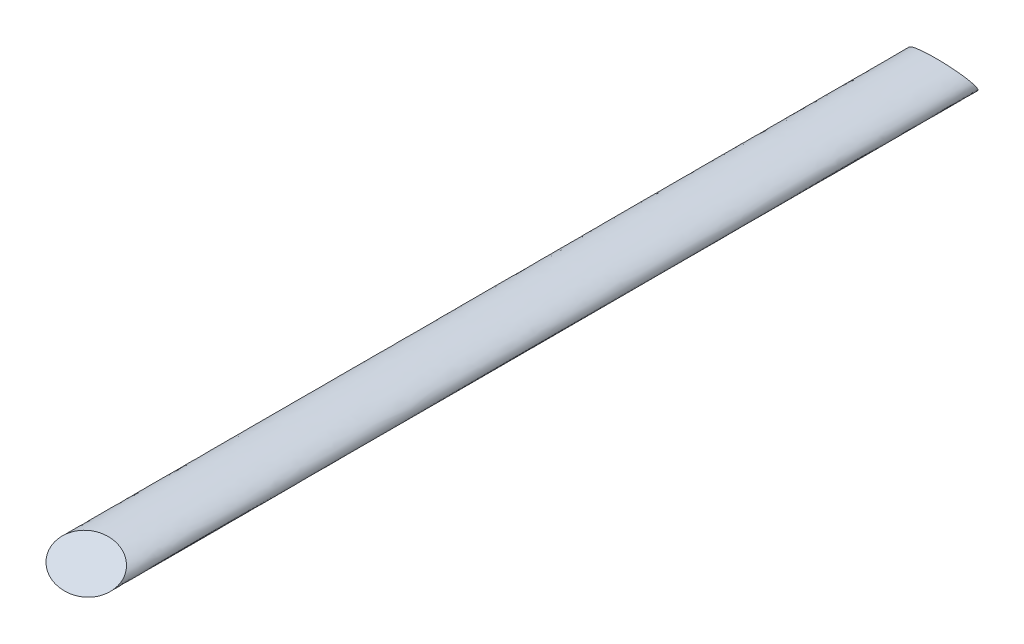
ISO-10303-21;
HEADER;
FILE_DESCRIPTION(('STEP AP214'),'2;1');
FILE_NAME('part.step','',(''),(''),'','','');
FILE_SCHEMA(('AUTOMOTIVE_DESIGN { 1 0 10303 214 1 1 1 1 }'));
ENDSEC;
DATA;
#1=APPLICATION_CONTEXT('core data for automotive mechanical design processes');
#2=APPLICATION_PROTOCOL_DEFINITION('international standard','automotive_design',2000,#1);
#3=PRODUCT_CONTEXT('',#1,'mechanical');
#4=PRODUCT('Part','Part','',(#3));
#5=PRODUCT_RELATED_PRODUCT_CATEGORY('part','',(#4));
#6=PRODUCT_DEFINITION_FORMATION('','',#4);
#7=PRODUCT_DEFINITION_CONTEXT('part definition',#1,'design');
#8=PRODUCT_DEFINITION('design','',#6,#7);
#9=PRODUCT_DEFINITION_SHAPE('','',#8);
#10=(LENGTH_UNIT() NAMED_UNIT(*) SI_UNIT(.MILLI.,.METRE.));
#11=(NAMED_UNIT(*) PLANE_ANGLE_UNIT() SI_UNIT($,.RADIAN.));
#12=(NAMED_UNIT(*) SI_UNIT($,.STERADIAN.) SOLID_ANGLE_UNIT());
#13=UNCERTAINTY_MEASURE_WITH_UNIT(LENGTH_MEASURE(1.E-05),#10,'distance_accuracy_value','');
#14=(GEOMETRIC_REPRESENTATION_CONTEXT(3) GLOBAL_UNCERTAINTY_ASSIGNED_CONTEXT((#13)) GLOBAL_UNIT_ASSIGNED_CONTEXT((#10,
#11,#12)) REPRESENTATION_CONTEXT('',''));
#15=CARTESIAN_POINT('',(0.,0.,0.));
#16=DIRECTION('',(0.,0.,1.));
#17=DIRECTION('',(1.,0.,0.));
#18=AXIS2_PLACEMENT_3D('',#15,#16,#17);
#19=CARTESIAN_POINT('',(0.,0.,1778.));
#20=DIRECTION('',(0.,0.,1.));
#21=DIRECTION('',(1.,0.,0.));
#22=AXIS2_PLACEMENT_3D('',#19,#20,#21);
#23=ELLIPSE('',#22,67.7799,25.3619);
#24=DIRECTION('',(0.,0.,-1.));
#25=VECTOR('',#24,1.);
#26=SURFACE_OF_LINEAR_EXTRUSION('',#23,#25);
#27=CARTESIAN_POINT('',(67.7799,0.,14.6426997921607));
#28=CARTESIAN_POINT('',(67.7798910037621,0.349790943579269,14.8446516875963));
#29=CARTESIAN_POINT('',(67.7605001071177,0.699681218808721,15.0466609321868));
#30=CARTESIAN_POINT('',(67.6835033866562,1.39643950552637,15.4489345165833));
#31=CARTESIAN_POINT('',(67.6258733934636,1.74330546489522,15.6491976715977));
#32=CARTESIAN_POINT('',(67.4739329728442,2.43181012790774,16.0467060241263));
#33=CARTESIAN_POINT('',(67.3795335130426,2.77343403566413,16.243942679231));
#34=CARTESIAN_POINT('',(67.1566837348068,3.44815659278839,16.633493929215));
#35=CARTESIAN_POINT('',(67.02823484939,3.78125560029177,16.8258087308639));
#36=CARTESIAN_POINT('',(66.711772111613,4.50243086337088,17.2421794631356));
#37=CARTESIAN_POINT('',(66.5169941054856,4.88828002338972,17.464949579539));
#38=CARTESIAN_POINT('',(66.088645253169,5.64344033594759,17.9009415892756));
#39=CARTESIAN_POINT('',(65.8550639433078,6.01274699344933,18.1141608873978));
#40=CARTESIAN_POINT('',(65.3543681462539,6.73436275870593,18.5307859437202));
#41=CARTESIAN_POINT('',(65.0872158768496,7.08665208608278,18.7341802817138));
#42=CARTESIAN_POINT('',(64.5245764698198,7.77373491513087,19.1308677380203));
#43=CARTESIAN_POINT('',(64.2290885328798,8.10852792284053,19.3241605711444));
#44=CARTESIAN_POINT('',(63.5862970891053,8.79056240284762,19.7179333617731));
#45=CARTESIAN_POINT('',(63.2367242055503,9.13619395058566,19.9174838289));
#46=CARTESIAN_POINT('',(62.513540065172,9.80830647157022,20.3055281738162));
#47=CARTESIAN_POINT('',(62.1399152639438,10.1347764529795,20.4940157054652));
#48=CARTESIAN_POINT('',(61.3725594304966,10.769572671261,20.8605154729706));
#49=CARTESIAN_POINT('',(60.9788236360692,11.0778945731841,21.0385252060429));
#50=CARTESIAN_POINT('',(60.1737485091036,11.6780294183802,21.385013220467));
#51=CARTESIAN_POINT('',(59.7623788138763,11.9698116987807,21.553473798601));
#52=CARTESIAN_POINT('',(58.925400616485,12.5373391289732,21.8811359131951));
#53=CARTESIAN_POINT('',(58.4997967541066,12.8130894258401,22.0403404213203));
#54=CARTESIAN_POINT('',(57.6363498931754,13.3497232847913,22.3501661242421));
#55=CARTESIAN_POINT('',(57.1985075473788,13.6106076375244,22.5007877755199));
#56=CARTESIAN_POINT('',(56.0934219712956,14.2439870942908,22.8664695753832));
#57=CARTESIAN_POINT('',(55.4196694509468,14.6079775857306,23.0766195835984));
#58=CARTESIAN_POINT('',(54.053210314278,15.3080739032076,23.4808203809524));
#59=CARTESIAN_POINT('',(53.3605029963411,15.6441786951864,23.6748705730773));
#60=CARTESIAN_POINT('',(51.9605482921065,16.2905998469661,24.0480819990672));
#61=CARTESIAN_POINT('',(51.2533231398855,16.6009524348828,24.2272641492446));
#62=CARTESIAN_POINT('',(49.826042395663,17.1985680822693,24.5722977041351));
#63=CARTESIAN_POINT('',(49.1059870145356,17.4858315207989,24.7381493276986));
#64=CARTESIAN_POINT('',(47.6568845095359,18.0384522737313,25.0572050681639));
#65=CARTESIAN_POINT('',(46.9278636523035,18.3038613941746,25.2104390952972));
#66=CARTESIAN_POINT('',(45.4607656352684,18.8151223153368,25.5056157257563));
#67=CARTESIAN_POINT('',(44.7226885552337,19.0609742881742,25.6475584284547));
#68=CARTESIAN_POINT('',(43.2385293690062,19.5345596271362,25.9209830513888));
#69=CARTESIAN_POINT('',(42.4924443842546,19.7622862121774,26.0524610565639));
#70=CARTESIAN_POINT('',(40.9936124209839,20.200686095951,26.3055713474733));
#71=CARTESIAN_POINT('',(40.2408652350599,20.4113588616842,26.4272033254803));
#72=CARTESIAN_POINT('',(38.7281734859095,20.8170402124144,26.6614235625296));
#73=CARTESIAN_POINT('',(37.9682178070331,21.0120176707892,26.7739938506082));
#74=CARTESIAN_POINT('',(36.4433007264746,21.386724993417,26.9903312241947));
#75=CARTESIAN_POINT('',(35.6783391387366,21.566454287431,27.094097980475));
#76=CARTESIAN_POINT('',(33.3767481606405,22.0839752141735,27.392888826841));
#77=CARTESIAN_POINT('',(31.8335566021722,22.4000616329374,27.5753814058015));
#78=CARTESIAN_POINT('',(28.7337426249838,22.9793209485549,27.9098169276039));
#79=CARTESIAN_POINT('',(27.1771170613038,23.2424810842909,28.061752502811));
#80=CARTESIAN_POINT('',(24.0540252854288,23.7194949147304,28.3371565662225));
#81=CARTESIAN_POINT('',(22.4875601183012,23.9333537577307,28.4606280267973));
#82=CARTESIAN_POINT('',(19.3532601040241,24.3138563879765,28.6803113227971));
#83=CARTESIAN_POINT('',(17.7854543205172,24.4806807120707,28.7766273912202));
#84=CARTESIAN_POINT('',(14.6449555676662,24.7702081774604,28.9437861513007));
#85=CARTESIAN_POINT('',(13.0722643448696,24.8929255854511,29.0146370798384));
#86=CARTESIAN_POINT('',(9.92062115051752,25.0959127301892,29.131831762495));
#87=CARTESIAN_POINT('',(8.34166311813537,25.1761115957204,29.1781345990981));
#88=CARTESIAN_POINT('',(5.18157466921749,25.2946619855871,29.2465796986003));
#89=CARTESIAN_POINT('',(3.60044413725221,25.3330111928936,29.2687206237618));
#90=CARTESIAN_POINT('',(0.436790262277459,25.3682887202652,29.2890881136862));
#91=CARTESIAN_POINT('',(-1.1457333831465,25.365196623235,29.2873028906335));
#92=CARTESIAN_POINT('',(-4.30991688345228,25.3175083797187,29.2597700704021));
#93=CARTESIAN_POINT('',(-5.8915767556384,25.2729130976694,29.2340229723063));
#94=CARTESIAN_POINT('',(-9.05301409673554,25.1417053132771,29.1582701226676));
#95=CARTESIAN_POINT('',(-10.632790933043,25.0550813308982,29.1082577431229));
#96=CARTESIAN_POINT('',(-13.7884760276078,24.8388226072037,28.9834007107834));
#97=CARTESIAN_POINT('',(-15.3643841723437,24.7091866186067,28.9085553378702));
#98=CARTESIAN_POINT('',(-18.5097426083125,24.4054498928525,28.7331928574932));
#99=CARTESIAN_POINT('',(-20.0791956281727,24.2313704560664,28.6326880478044));
#100=CARTESIAN_POINT('',(-23.2101462988454,23.8365828722496,28.4047573300151));
#101=CARTESIAN_POINT('',(-24.7716446251869,23.6158787546379,28.2773337483007));
#102=CARTESIAN_POINT('',(-27.8819508966912,23.1252981752947,27.9940969187577));
#103=CARTESIAN_POINT('',(-29.4307745931867,22.8554974031835,27.8383273703517));
#104=CARTESIAN_POINT('',(-31.7438080678566,22.4108540747824,27.5816124250059));
#105=CARTESIAN_POINT('',(-32.5131819716598,22.255968168619,27.4921890053889));
#106=CARTESIAN_POINT('',(-34.0480075899545,21.9322757119421,27.3053050783917));
#107=CARTESIAN_POINT('',(-34.8134594191996,21.7634695712111,27.2078448075998));
#108=CARTESIAN_POINT('',(-36.3404561588233,21.4111264759026,27.0044194266763));
#109=CARTESIAN_POINT('',(-37.1019976626133,21.2275784370984,26.8984479170635));
#110=CARTESIAN_POINT('',(-38.6198863127986,20.8450860357166,26.6776158261628));
#111=CARTESIAN_POINT('',(-39.376233656077,20.6461422602562,26.5627555838471));
#112=CARTESIAN_POINT('',(-40.8826259220549,20.2320437846011,26.3236757174566));
#113=CARTESIAN_POINT('',(-41.632673520058,20.0168963973813,26.1994603155298));
#114=CARTESIAN_POINT('',(-43.1258589346036,19.5692707653267,25.9410235363669));
#115=CARTESIAN_POINT('',(-43.8689967296573,19.3367924666144,25.8068021280245));
#116=CARTESIAN_POINT('',(-45.3476154893697,18.8531656037959,25.5275800285889));
#117=CARTESIAN_POINT('',(-46.0830919978356,18.6020067976217,25.382573424235));
#118=CARTESIAN_POINT('',(-47.5445577136322,18.0797261620909,25.0810345587188));
#119=CARTESIAN_POINT('',(-48.2705469334174,17.808604358944,24.9245023126887));
#120=CARTESIAN_POINT('',(-49.7128308400485,17.2441515315517,24.5986153208489));
#121=CARTESIAN_POINT('',(-50.4291013432064,16.9507740360997,24.4292337448755));
#122=CARTESIAN_POINT('',(-51.8480891230316,16.3404104487972,24.0768401634428));
#123=CARTESIAN_POINT('',(-52.5508075227154,16.0234263238221,23.8938292935596));
#124=CARTESIAN_POINT('',(-53.8201383237958,15.4204495262558,23.5457004771696));
#125=CARTESIAN_POINT('',(-54.3893310128523,15.1385340431195,23.3829364970922));
#126=CARTESIAN_POINT('',(-55.5145410995508,14.5554409635617,23.0462875506469));
#127=CARTESIAN_POINT('',(-56.0705570102473,14.2542612072973,22.8724013372932));
#128=CARTESIAN_POINT('',(-57.1670432421486,13.6308432760421,22.5124708268653));
#129=CARTESIAN_POINT('',(-57.7075062496742,13.3085954196053,22.3264209402057));
#130=CARTESIAN_POINT('',(-58.7676969666519,12.6423262779312,21.9417502719075));
#131=CARTESIAN_POINT('',(-59.2874851194502,12.2983774502397,21.7431713236523));
#132=CARTESIAN_POINT('',(-60.3038411212142,11.5858562174858,21.3317969981185));
#133=CARTESIAN_POINT('',(-60.8004172653019,11.217292724946,21.1190067664872));
#134=CARTESIAN_POINT('',(-61.7649215540982,10.4535176231355,20.6780410058565));
#135=CARTESIAN_POINT('',(-62.2328735684023,10.0583288109699,20.449878638772));
#136=CARTESIAN_POINT('',(-63.0056683336979,9.355391108976,20.0440373673022));
#137=CARTESIAN_POINT('',(-63.3190763948613,9.05470308506299,19.870435055754));
#138=CARTESIAN_POINT('',(-63.9248128102308,8.43778157819745,19.5142552576963));
#139=CARTESIAN_POINT('',(-64.2171429649131,8.12154942691533,19.3316785400272));
#140=CARTESIAN_POINT('',(-64.7772779466916,7.47283059211265,18.9571405461254));
#141=CARTESIAN_POINT('',(-65.04507109333,7.14033628157257,18.7651748664311));
#142=CARTESIAN_POINT('',(-65.4249916862645,6.62952365625298,18.4702570596974));
#143=CARTESIAN_POINT('',(-65.5480054386801,6.45723814990446,18.3707879762296));
#144=CARTESIAN_POINT('',(-65.7862581688927,6.10859365501096,18.1694979832513));
#145=CARTESIAN_POINT('',(-65.9014941454257,5.93223312884971,18.0676761859976));
#146=CARTESIAN_POINT('',(-66.2377822341872,5.392047802762,17.7558000425685));
#147=CARTESIAN_POINT('',(-66.4457440981325,5.02200454113954,17.5421554658591));
#148=CARTESIAN_POINT('',(-66.8216115903918,4.26694979951303,17.1062244075282));
#149=CARTESIAN_POINT('',(-66.989530331482,3.88194326763954,16.8839407827112));
#150=CARTESIAN_POINT('',(-67.2073488946138,3.29544832902938,16.5453277720263));
#151=CARTESIAN_POINT('',(-67.2742384300636,3.09861406484945,16.4316854566163));
#152=CARTESIAN_POINT('',(-67.3961805029433,2.70223758058226,16.2028373867242));
#153=CARTESIAN_POINT('',(-67.4512354712896,2.50269592558469,16.0876319584968));
#154=CARTESIAN_POINT('',(-67.5489899355569,2.10137146047755,15.8559271705348));
#155=CARTESIAN_POINT('',(-67.5916907427388,1.89958889057938,15.7394279494863));
#156=CARTESIAN_POINT('',(-67.6643255604718,1.49431942378887,15.5054455137405));
#157=CARTESIAN_POINT('',(-67.694259495332,1.29083251679933,15.3879622932135));
#158=CARTESIAN_POINT('',(-67.7578597940612,0.735827815195225,15.0675301793409));
#159=CARTESIAN_POINT('',(-67.7787164489955,0.383139213501003,14.8639053202126));
#160=CARTESIAN_POINT('',(-67.7809858571123,-0.322242476190983,14.4566530117874));
#161=CARTESIAN_POINT('',(-67.762403306685,-0.674935558654036,14.2530255656861));
#162=CARTESIAN_POINT('',(-67.6863954763988,-1.37734281365972,13.8474905479278));
#163=CARTESIAN_POINT('',(-67.6289502065923,-1.72705535930663,13.6455839155596));
#164=CARTESIAN_POINT('',(-67.4769492169595,-2.42036295076814,13.245302590998));
#165=CARTESIAN_POINT('',(-67.3823893303789,-2.76395730518131,13.0469282979855));
#166=CARTESIAN_POINT('',(-67.1485413216587,-3.4736968412847,12.6371599857617));
#167=CARTESIAN_POINT('',(-67.0059482399121,-3.8390228660457,12.426238907024));
#168=CARTESIAN_POINT('',(-66.683816754017,-4.55718603506347,12.0116072080695));
#169=CARTESIAN_POINT('',(-66.5042744250187,-4.91002184790558,11.8078973565454));
#170=CARTESIAN_POINT('',(-66.1124174046333,-5.60219539568434,11.4082707724093));
#171=CARTESIAN_POINT('',(-65.9000643497157,-5.94151673723264,11.2123635045246));
#172=CARTESIAN_POINT('',(-65.4469135307597,-6.60569492772687,10.8289000474529));
#173=CARTESIAN_POINT('',(-65.2061055402178,-6.9305465182376,10.6413468942249));
#174=CARTESIAN_POINT('',(-64.7581729471953,-7.49257106206429,10.3168618725554));
#175=CARTESIAN_POINT('',(-64.5560204679696,-7.73274101734097,10.1781996842251));
#176=CARTESIAN_POINT('',(-64.1388276431907,-8.20441883064056,9.90587637174578));
#177=CARTESIAN_POINT('',(-63.9237902574708,-8.43592865831249,9.77221411041935));
#178=CARTESIAN_POINT('',(-63.2611786939519,-9.11812152974702,9.37834987245739));
#179=CARTESIAN_POINT('',(-62.7962771850676,-9.55625557307325,9.12539306460184));
#180=CARTESIAN_POINT('',(-61.8293590747771,-10.4016581472294,8.63729966083918));
#181=CARTESIAN_POINT('',(-61.3272833559153,-10.80887533467,8.4021927080517));
#182=CARTESIAN_POINT('',(-60.294000342756,-11.5942519700288,7.94875529621205));
#183=CARTESIAN_POINT('',(-59.7627987857899,-11.9724171057538,7.73042155330299));
#184=CARTESIAN_POINT('',(-58.7035966667668,-12.6842602600349,7.31943871655801));
#185=CARTESIAN_POINT('',(-58.176730801192,-13.0192125752126,7.12605390722455));
#186=CARTESIAN_POINT('',(-57.1053858194903,-13.6671932470518,6.75194209190851));
#187=CARTESIAN_POINT('',(-56.5609068304863,-13.9802217618971,6.57121499459855));
#188=CARTESIAN_POINT('',(-55.4580131812786,-14.5857409815112,6.22161831015482));
#189=CARTESIAN_POINT('',(-54.8996183332215,-14.8782588503646,6.05273303982955));
#190=CARTESIAN_POINT('',(-53.7704377422694,-15.4448393256189,5.72561764992385));
#191=CARTESIAN_POINT('',(-53.1996507619117,-15.7189000776019,5.56738860099213));
#192=CARTESIAN_POINT('',(-52.1530624295756,-16.2013143979671,5.28886656326838));
#193=CARTESIAN_POINT('',(-51.6790017742322,-16.4125119359095,5.16693160788515));
#194=CARTESIAN_POINT('',(-50.7246996069522,-16.8241767051786,4.92925684253179));
#195=CARTESIAN_POINT('',(-50.244457851065,-17.0246435113727,4.81351727801201));
#196=CARTESIAN_POINT('',(-48.7954406715735,-17.6109205441368,4.47503007532596));
#197=CARTESIAN_POINT('',(-47.8184478713125,-17.9815733371394,4.26103358551));
#198=CARTESIAN_POINT('',(-45.8463354275601,-18.6868842219927,3.85382215627759));
#199=CARTESIAN_POINT('',(-44.8511992930931,-19.0215074408205,3.66062735081028));
#200=CARTESIAN_POINT('',(-42.8470571302087,-19.6577192179649,3.29331031001431));
#201=CARTESIAN_POINT('',(-41.8380519719827,-19.9593098383104,3.11918688417278));
#202=CARTESIAN_POINT('',(-39.8121394426364,-20.5312564737687,2.78897334022882));
#203=CARTESIAN_POINT('',(-38.7952705040788,-20.8017150042287,2.63282403486311));
#204=CARTESIAN_POINT('',(-36.7522343944507,-21.314817766314,2.33658401705125));
#205=CARTESIAN_POINT('',(-35.7260671162958,-21.5574616771711,2.19649348980066));
#206=CARTESIAN_POINT('',(-33.666528302922,-22.0166713458462,1.93136866397657));
#207=CARTESIAN_POINT('',(-32.6331604513763,-22.2332495311852,1.80632719037048));
#208=CARTESIAN_POINT('',(-30.5600296502507,-22.6419932940855,1.57033886883046));
#209=CARTESIAN_POINT('',(-29.5202667342811,-22.8341589998356,1.45939194688664));
#210=CARTESIAN_POINT('',(-27.436184467294,-23.195216714658,1.25093517804096));
#211=CARTESIAN_POINT('',(-26.3918690812485,-23.364125930873,1.15341539659054));
#212=CARTESIAN_POINT('',(-24.298812285443,-23.6798923454095,0.971107572156863));
#213=CARTESIAN_POINT('',(-23.250070874034,-23.8267495355134,0.886319533917912));
#214=CARTESIAN_POINT('',(-21.1488420900075,-24.0992934035857,0.728966258320387));
#215=CARTESIAN_POINT('',(-20.0963544035057,-24.2249782628471,0.656402070992738));
#216=CARTESIAN_POINT('',(-17.9883968825085,-24.4558739777352,0.523094367847434));
#217=CARTESIAN_POINT('',(-16.9329270498014,-24.561084845638,0.462350844942134));
#218=CARTESIAN_POINT('',(-14.8199878212193,-24.7515734906889,0.35237217444444));
#219=CARTESIAN_POINT('',(-13.7625193128971,-24.8368586516643,0.303132763797346));
#220=CARTESIAN_POINT('',(-11.645724329549,-24.9879929483187,0.215875336940066));
#221=CARTESIAN_POINT('',(-10.5863978055008,-25.0538415631773,0.177857621425707));
#222=CARTESIAN_POINT('',(-7.40652907129811,-25.2227621265714,0.0803312886784732));
#223=CARTESIAN_POINT('',(-5.28386826405789,-25.2972292935367,0.0373376497852915));
#224=CARTESIAN_POINT('',(-1.03706039125425,-25.3713988019454,-0.00548413586012981));
#225=CARTESIAN_POINT('',(1.0870865618494,-25.3711062934848,-0.00531525602166601));
#226=CARTESIAN_POINT('',(5.33378940493879,-25.2957622495727,0.0381846480127689));
#227=CARTESIAN_POINT('',(7.45634524115425,-25.220708292362,0.0815170704120743));
#228=CARTESIAN_POINT('',(10.6361476035281,-25.0508922198616,0.179560425582979));
#229=CARTESIAN_POINT('',(11.6955236551169,-24.9847374689245,0.21775488884465));
#230=CARTESIAN_POINT('',(13.8124092979579,-24.8329819694379,0.305370967324312));
#231=CARTESIAN_POINT('',(14.8699189385281,-24.7473817427088,0.35479228126904));
#232=CARTESIAN_POINT('',(16.9824729905848,-24.5562934330145,0.465117168310016));
#233=CARTESIAN_POINT('',(18.0375175519064,-24.4508065924281,0.526020024118517));
#234=CARTESIAN_POINT('',(20.1446161130309,-24.21936401661,0.659643457569054));
#235=CARTESIAN_POINT('',(21.1966701134798,-24.0934082857987,0.732364032658905));
#236=CARTESIAN_POINT('',(23.2974195346999,-23.8202747719874,0.890057740382603));
#237=CARTESIAN_POINT('',(24.3461138879047,-23.673090818014,0.975034435829567));
#238=CARTESIAN_POINT('',(26.4390672183339,-23.35665540153,1.15772850871773));
#239=CARTESIAN_POINT('',(27.4833261835192,-23.1874038791604,1.25544592071857));
#240=CARTESIAN_POINT('',(29.5668864108441,-22.8257115683671,1.46426907371889));
#241=CARTESIAN_POINT('',(30.606185718422,-22.633262314709,1.57537970212371));
#242=CARTESIAN_POINT('',(32.678365071728,-22.2239509296091,1.81169574049357));
#243=CARTESIAN_POINT('',(33.7112451574762,-22.0070889505283,1.93690106249287));
#244=CARTESIAN_POINT('',(35.7708861585819,-21.5470628136023,2.20249727648139));
#245=CARTESIAN_POINT('',(36.7976351862138,-21.3038586244102,2.34291128057947));
#246=CARTESIAN_POINT('',(38.8418432845787,-20.7895547870549,2.63984473952176));
#247=CARTESIAN_POINT('',(39.8593020622242,-20.51845426211,2.79636470057617));
#248=CARTESIAN_POINT('',(41.8819159468981,-19.9463895054285,3.12664644184017));
#249=CARTESIAN_POINT('',(42.8870819036118,-19.6454541218232,3.30039156657335));
#250=CARTESIAN_POINT('',(44.8835009529679,-19.0107962411867,3.66681146480218));
#251=CARTESIAN_POINT('',(45.8747554033913,-18.6770769696995,3.85948437602924));
#252=CARTESIAN_POINT('',(47.4402956723397,-18.1165976709009,4.18307725006575));
#253=CARTESIAN_POINT('',(48.020189020529,-17.9015425739218,4.30723936819717));
#254=CARTESIAN_POINT('',(49.1730565231363,-17.4578623596537,4.56339825933896));
#255=CARTESIAN_POINT('',(49.7460304543872,-17.2292368060855,4.69539528423517));
#256=CARTESIAN_POINT('',(50.8850402484906,-16.7570571087226,4.96800835961357));
#257=CARTESIAN_POINT('',(51.4510612428139,-16.5134760174839,5.10863996820969));
#258=CARTESIAN_POINT('',(52.5737576188787,-16.0107234947793,5.39890427252899));
#259=CARTESIAN_POINT('',(53.1304337878602,-15.7515533851014,5.54853620511741));
#260=CARTESIAN_POINT('',(54.2214491659392,-15.221968027571,5.8542924538465));
#261=CARTESIAN_POINT('',(54.7560121248687,-14.9518992966434,6.01021670834722));
#262=CARTESIAN_POINT('',(55.8129907698629,-14.3943184781689,6.33213614398846));
#263=CARTESIAN_POINT('',(56.3354050117109,-14.1068043312588,6.49813251410286));
#264=CARTESIAN_POINT('',(57.3659871474342,-13.512800362474,6.84108086538049));
#265=CARTESIAN_POINT('',(57.8741494212698,-13.2063032036461,7.01803708253562));
#266=CARTESIAN_POINT('',(58.8719903106799,-12.5735979816227,7.38332961278849));
#267=CARTESIAN_POINT('',(59.3617113418425,-12.2474402899086,7.5716368438979));
#268=CARTESIAN_POINT('',(60.320328114349,-11.5730896426234,7.96097337163625));
#269=CARTESIAN_POINT('',(60.7892300639235,-11.2249033320948,8.16199883174806));
#270=CARTESIAN_POINT('',(61.7016389295486,-10.5047796000851,8.57776246227368));
#271=CARTESIAN_POINT('',(62.1451633382942,-10.132858922023,8.79249096586998));
#272=CARTESIAN_POINT('',(62.8998014419969,-9.45463305128442,9.18406485491231));
#273=CARTESIAN_POINT('',(63.2173573195723,-9.15370553367689,9.35780543820962));
#274=CARTESIAN_POINT('',(63.8314900133614,-8.53615712100521,9.71434718050327));
#275=CARTESIAN_POINT('',(64.1280683135091,-8.21953733869723,9.89714769704953));
#276=CARTESIAN_POINT('',(64.6968554859589,-7.56979803949528,10.2722748563469));
#277=CARTESIAN_POINT('',(64.9690434194213,-7.23666471981601,10.4646094681398));
#278=CARTESIAN_POINT('',(65.4845393920234,-6.55390622049685,10.8588002715131));
#279=CARTESIAN_POINT('',(65.7278477496901,-6.20428122281113,11.0606563580423));
#280=CARTESIAN_POINT('',(66.1075794768661,-5.6045298004395,11.4069230031955));
#281=CARTESIAN_POINT('',(66.2531474996732,-5.35872899963,11.5488361617099));
#282=CARTESIAN_POINT('',(66.5272554429018,-4.86005056203638,11.8367482918937));
#283=CARTESIAN_POINT('',(66.6557942473522,-4.60717246277165,11.9827475305764));
#284=CARTESIAN_POINT('',(66.8942372720554,-4.09481913597492,12.2785548617226));
#285=CARTESIAN_POINT('',(67.0041369519335,-3.83534231868686,12.4283638720324));
#286=CARTESIAN_POINT('',(67.2032929696372,-3.31164876462423,12.7307184864433));
#287=CARTESIAN_POINT('',(67.2926307130143,-3.04745534308531,12.8832506294869));
#288=CARTESIAN_POINT('',(67.4497940446848,-2.51435802755567,13.1910345081123));
#289=CARTESIAN_POINT('',(67.5176243039312,-2.24545516975606,13.3462856454487));
#290=CARTESIAN_POINT('',(67.6305623606733,-1.70435402705707,13.6586905358448));
#291=CARTESIAN_POINT('',(67.6756938909426,-1.43215949009956,13.8158421250291));
#292=CARTESIAN_POINT('',(67.7326245301975,-0.966487220504303,14.0846981352341));
#293=CARTESIAN_POINT('',(67.7503342723923,-0.773539022172769,14.1960968294805));
#294=CARTESIAN_POINT('',(67.7739756733508,-0.387070757944317,14.4192243858661));
#295=CARTESIAN_POINT('',(67.7799049779079,-0.193550585480745,14.5309533095316));
#296=CARTESIAN_POINT('',(67.7799,0.,14.6426997921607));
#297=B_SPLINE_CURVE_WITH_KNOTS('',3,(#27,#28,#29,#30,#31,#32,#33,#34,#35,#36,#37,#38,#39,#40,
#41,#42,#43,#44,#45,#46,#47,#48,#49,#50,#51,#52,#53,#54,#55,#56,#57,#58,#59,#60,#61,#62,#63,#64,
#65,#66,#67,#68,#69,#70,#71,#72,#73,#74,#75,#76,#77,#78,#79,#80,#81,#82,#83,#84,#85,#86,#87,#88,
#89,#90,#91,#92,#93,#94,#95,#96,#97,#98,#99,#100,#101,#102,#103,#104,#105,#106,#107,#108,#109,
#110,#111,#112,#113,#114,#115,#116,#117,#118,#119,#120,#121,#122,#123,#124,#125,#126,#127,#128,
#129,#130,#131,#132,#133,#134,#135,#136,#137,#138,#139,#140,#141,#142,#143,#144,#145,#146,#147,
#148,#149,#150,#151,#152,#153,#154,#155,#156,#157,#158,#159,#160,#161,#162,#163,#164,#165,#166,
#167,#168,#169,#170,#171,#172,#173,#174,#175,#176,#177,#178,#179,#180,#181,#182,#183,#184,#185,
#186,#187,#188,#189,#190,#191,#192,#193,#194,#195,#196,#197,#198,#199,#200,#201,#202,#203,#204,
#205,#206,#207,#208,#209,#210,#211,#212,#213,#214,#215,#216,#217,#218,#219,#220,#221,#222,#223,
#224,#225,#226,#227,#228,#229,#230,#231,#232,#233,#234,#235,#236,#237,#238,#239,#240,#241,#242,
#243,#244,#245,#246,#247,#248,#249,#250,#251,#252,#253,#254,#255,#256,#257,#258,#259,#260,#261,
#262,#263,#264,#265,#266,#267,#268,#269,#270,#271,#272,#273,#274,#275,#276,#277,#278,#279,#280,
#281,#282,#283,#284,#285,#286,#287,#288,#289,#290,#291,#292,#293,#294,#295,#296),.UNSPECIFIED.,
.T.,.F.,(4,2,2,2,2,2,2,2,2,2,2,2,2,2,2,2,2,2,2,2,2,2,2,2,2,2,2,2,2,2,2,2,2,2,2,2,2,2,2,2,2,2,2,
2,2,2,2,2,2,2,2,2,2,2,2,2,2,2,2,2,2,2,2,2,2,2,2,2,2,2,2,2,2,2,2,2,2,2,2,2,2,2,2,2,2,2,2,2,2,2,2,
2,2,2,2,2,2,2,2,2,2,2,2,2,2,2,2,2,2,2,2,2,2,2,2,2,2,2,2,2,2,2,2,2,2,2,2,2,2,2,2,2,2,2,4),(0.,
1.21145241063362,2.42367126131969,3.63884377046086,4.8539651454925,6.31052741672158,
7.76748310300305,9.22609344762202,10.6847449499624,12.2752368166755,13.8666323107942,
15.4584064044455,17.0530409737882,18.6471607253808,20.2411956140628,22.6224126055855,
25.0037178580453,27.3816142031075,29.7594715017186,32.1315192497087,34.5035461194755,
36.8764562826999,39.2494405801297,41.6270205801537,44.0046894559002,48.7604788097483,
53.5174134664144,58.2738511540395,63.011775187107,67.7481653228779,72.4924255940792,
77.2369485205115,81.9838090407485,86.7305706946056,91.4786296452558,96.2268262942921,
100.972751537454,105.718266793817,110.45652719172,112.826048631005,115.195500341407,
117.566750594139,119.937910463645,122.30800652691,124.678109958514,127.049522577738,
129.420932083557,131.797437262193,134.173744654381,136.140413381552,138.10730299255,
140.075102891198,142.036648544571,143.997487768712,145.956668912939,147.359164563107,
148.761540269723,150.164580124154,150.866121857264,151.567932769447,152.991685161916,
154.414970681144,155.125473861438,155.835830958837,156.546112631802,157.25639851575,
158.477716763152,159.698889585074,160.920691023838,162.142629670086,163.476554248599,
164.810620593422,166.146258750302,167.482378394507,168.511527730195,169.540441556329,
171.599164646808,173.661235074001,175.722900754995,177.682866574716,179.642818251517,
181.600123144049,183.557624397858,185.156765827111,186.755970564677,189.954632562095,
193.15636322859,196.357893916023,199.548560890848,202.739264657885,205.92844109529,
209.117600785777,212.304388035129,215.491176471993,218.678238515103,221.865298647251,
225.051175877353,228.237138468269,234.608372232913,240.979167091738,247.350168327422,
250.536355033521,253.722456248193,256.908358483101,260.094260029974,263.281089581399,
266.467927777393,269.655932443936,272.843917215075,276.036816494878,279.229816158168,
282.419757989842,285.609386282995,287.50166757815,289.394009741585,291.289867792896,
293.185565320953,295.041790120361,296.898234467763,298.75540086535,300.607996195357,
302.460035320993,304.310782066729,305.722264903955,307.133647794148,308.54623095832,
309.958798540979,310.91524504248,311.871754191553,312.828496006684,313.781382261111,
314.734061427602,315.685742433899,316.355944117817,317.026279721595),.UNSPECIFIED.);
#298=CARTESIAN_POINT('',(67.7799,0.,14.6426997921607));
#299=VERTEX_POINT('',#298);
#300=EDGE_CURVE('E41',#299,#299,#297,.T.);
#301=ORIENTED_EDGE('',*,*,#300,.T.);
#302=EDGE_LOOP('',(#301));
#303=FACE_BOUND('',#302,.T.);
#304=CARTESIAN_POINT('',(0.,-25.3619,1778.));
#305=CARTESIAN_POINT('',(-2.38214130012665,-25.3619001957807,1778.0000003391));
#306=CARTESIAN_POINT('',(-4.76431858846694,-25.3149429339563,1777.91866797584));
#307=CARTESIAN_POINT('',(-9.51385465032875,-25.126710489059,1777.59263981764));
#308=CARTESIAN_POINT('',(-11.8812130334299,-24.9854328314802,1777.34793973674));
#309=CARTESIAN_POINT('',(-16.5460566186231,-24.6105345717394,1776.6985969032));
#310=CARTESIAN_POINT('',(-18.8440485161632,-24.3784950125754,1776.29669259736));
#311=CARTESIAN_POINT('',(-23.3939376742243,-23.8202380032731,1775.32976309357));
#312=CARTESIAN_POINT('',(-25.645839015452,-23.4940289295591,1774.76475240401));
#313=CARTESIAN_POINT('',(-29.8439796769409,-22.7855928074472,1773.53770504659));
#314=CARTESIAN_POINT('',(-31.7969015763013,-22.4132643574219,1772.89281325405));
#315=CARTESIAN_POINT('',(-35.6351723093298,-21.5897203301137,1771.46639315648));
#316=CARTESIAN_POINT('',(-37.5205316768822,-21.1385171154906,1770.68488626421));
#317=CARTESIAN_POINT('',(-40.9670621778634,-20.2185449077407,1769.09144765884));
#318=CARTESIAN_POINT('',(-42.538674188981,-19.7595546157363,1768.29645315291));
#319=CARTESIAN_POINT('',(-45.6015638672363,-18.7787548576353,1766.59765813982));
#320=CARTESIAN_POINT('',(-47.0928560403997,-18.2569567902678,1765.69387737585));
#321=CARTESIAN_POINT('',(-49.7848230926491,-17.2236402594684,1763.90412064421));
#322=CARTESIAN_POINT('',(-50.9977001872225,-16.7200694620079,1763.0319104378));
#323=CARTESIAN_POINT('',(-53.3370143272479,-15.6648513006998,1761.20421896934));
#324=CARTESIAN_POINT('',(-54.4634602487607,-15.1132088860331,1760.24874627953));
#325=CARTESIAN_POINT('',(-56.4808838272909,-14.0341267578388,1758.37972120796));
#326=CARTESIAN_POINT('',(-57.3837170421777,-13.5122245231689,1757.47576002093));
#327=CARTESIAN_POINT('',(-59.10041346805,-12.4330863390108,1755.60663785758));
#328=CARTESIAN_POINT('',(-59.9143125054375,-11.8758647616325,1754.64150177448));
#329=CARTESIAN_POINT('',(-61.0187924182539,-11.0456609551544,1753.20354660103));
#330=CARTESIAN_POINT('',(-61.349802357014,-10.7859578518669,1752.75372763125));
#331=CARTESIAN_POINT('',(-61.9906659592147,-10.2601038398516,1751.84292176507));
#332=CARTESIAN_POINT('',(-62.3005211378422,-9.99395339476163,1751.38193567172));
#333=CARTESIAN_POINT('',(-62.8982402772229,-9.45524900332211,1750.44887229549));
#334=CARTESIAN_POINT('',(-63.1860851217564,-9.18268975351077,1749.97678582674));
#335=CARTESIAN_POINT('',(-63.7384684908583,-8.63165854828712,1749.02237178274));
#336=CARTESIAN_POINT('',(-64.0030021587905,-8.35318537569838,1748.54004209927));
#337=CARTESIAN_POINT('',(-64.5687207288273,-7.72267209525559,1747.4479610627));
#338=CARTESIAN_POINT('',(-64.8632813692659,-7.36913843785365,1746.83562280589));
#339=CARTESIAN_POINT('',(-65.4128449391811,-6.65433812550238,1745.59755234763));
#340=CARTESIAN_POINT('',(-65.6678356023739,-6.2930691120091,1744.97181606106));
#341=CARTESIAN_POINT('',(-66.1363783925677,-5.5638319088842,1743.70874017448));
#342=CARTESIAN_POINT('',(-66.3499273012333,-5.19586320138469,1743.07139967749));
#343=CARTESIAN_POINT('',(-66.7340500486622,-4.45417473584294,1741.78675757179));
#344=CARTESIAN_POINT('',(-66.9046045400926,-4.08045246869765,1741.13945161717));
#345=CARTESIAN_POINT('',(-67.2012675000475,-3.32864211221046,1739.83727788208));
#346=CARTESIAN_POINT('',(-67.3273784520268,-2.95055426803178,1739.18241052624));
#347=CARTESIAN_POINT('',(-67.5341329749438,-2.19128843807353,1737.8673235323));
#348=CARTESIAN_POINT('',(-67.6147794452215,-1.81011065091729,1737.20710423823));
#349=CARTESIAN_POINT('',(-67.7144990826689,-1.1485359755851,1736.06122328755));
#350=CARTESIAN_POINT('',(-67.7442856580592,-0.868530783226095,1735.576240068));
#351=CARTESIAN_POINT('',(-67.7790369711167,-0.308109914660038,1734.60556265003));
#352=CARTESIAN_POINT('',(-67.7840001354773,-0.0276942135616298,1734.11986840848));
#353=CARTESIAN_POINT('',(-67.7690746151422,0.532948643000366,1733.14880649602));
#354=CARTESIAN_POINT('',(-67.7491877914793,0.813175811010867,1732.66343880336));
#355=CARTESIAN_POINT('',(-67.6846537548847,1.37294456768577,1731.69389087631));
#356=CARTESIAN_POINT('',(-67.6400040549026,1.65248608465409,1731.2097107661));
#357=CARTESIAN_POINT('',(-67.5261497874471,2.2102836206457,1730.24357709342));
#358=CARTESIAN_POINT('',(-67.456947971811,2.48853978019456,1729.76162328757));
#359=CARTESIAN_POINT('',(-67.29428907133,3.04330100382327,1728.80074866217));
#360=CARTESIAN_POINT('',(-67.2008294635063,3.31980588269158,1728.32182816343));
#361=CARTESIAN_POINT('',(-66.9900746473928,3.87049998625694,1727.36799799663));
#362=CARTESIAN_POINT('',(-66.8727825853235,4.14468951164206,1726.89308780776));
#363=CARTESIAN_POINT('',(-66.6148575030943,4.6903180988275,1725.94803137269));
#364=CARTESIAN_POINT('',(-66.4742222856777,4.96175689915164,1725.47788557938));
#365=CARTESIAN_POINT('',(-66.0298951881193,5.75038438860377,1724.11194269941));
#366=CARTESIAN_POINT('',(-65.6954486825841,6.26332436507326,1723.22350459893));
#367=CARTESIAN_POINT('',(-64.9471517533078,7.27440297916482,1721.47226506888));
#368=CARTESIAN_POINT('',(-64.5333004084914,7.77254144501584,1720.60946393682));
#369=CARTESIAN_POINT('',(-63.631770848418,8.75154774488945,1718.91377528451));
#370=CARTESIAN_POINT('',(-63.1441245239916,9.23242292878739,1718.0808750339));
#371=CARTESIAN_POINT('',(-62.1007413999056,10.1751742221251,1716.44798189493));
#372=CARTESIAN_POINT('',(-61.5450126337513,10.6370525645557,1715.64798513893));
#373=CARTESIAN_POINT('',(-60.1707356602815,11.6947864680144,1713.81593627725));
#374=CARTESIAN_POINT('',(-59.3272221763308,12.2825653807982,1712.79787333669));
#375=CARTESIAN_POINT('',(-57.5420289679246,13.4191172689356,1710.829307721));
#376=CARTESIAN_POINT('',(-56.6003722916662,13.9678993517191,1709.87878927133));
#377=CARTESIAN_POINT('',(-54.6225912289847,15.0302541418992,1708.03873679908));
#378=CARTESIAN_POINT('',(-53.5856937974534,15.5434660311368,1707.14982773187));
#379=CARTESIAN_POINT('',(-51.4362200819148,16.5289483859887,1705.4429222233));
#380=CARTESIAN_POINT('',(-50.3236106214559,17.0012006945574,1704.62495723087));
#381=CARTESIAN_POINT('',(-48.0323595427902,17.9051492185346,1703.05927245992));
#382=CARTESIAN_POINT('',(-46.85364073037,18.3367963774906,1702.31163764966));
#383=CARTESIAN_POINT('',(-44.4411163527865,19.1592140084248,1700.88716852784));
#384=CARTESIAN_POINT('',(-43.2073250199379,19.5499949551331,1700.21031607351));
#385=CARTESIAN_POINT('',(-40.5031478757191,20.3472964512358,1698.82934937331));
#386=CARTESIAN_POINT('',(-39.0251084933374,20.7473283158601,1698.13647385914));
#387=CARTESIAN_POINT('',(-36.0192110141412,21.4949696907596,1696.84152101197));
#388=CARTESIAN_POINT('',(-34.4914105835025,21.842637426977,1696.23934282869));
#389=CARTESIAN_POINT('',(-31.3940242333388,22.4871727483218,1695.12297490485));
#390=CARTESIAN_POINT('',(-29.8244479077137,22.7840518827749,1694.60876516027));
#391=CARTESIAN_POINT('',(-26.6507538255837,23.3282726159838,1693.66614719982));
#392=CARTESIAN_POINT('',(-25.0466214883624,23.5755928315284,1693.23777602076));
#393=CARTESIAN_POINT('',(-21.0853378790017,24.1216033735076,1692.29205802058));
#394=CARTESIAN_POINT('',(-18.7132778223798,24.39354804999,1691.82103602406));
#395=CARTESIAN_POINT('',(-13.9319600417709,24.8374654969071,1691.05214845164));
#396=CARTESIAN_POINT('',(-11.5226946723314,25.0094174311197,1690.75431896512));
#397=CARTESIAN_POINT('',(-6.68538757755658,25.254739677743,1690.32940836974));
#398=CARTESIAN_POINT('',(-4.25735550410919,25.3281576621979,1690.20224469048));
#399=CARTESIAN_POINT('',(0.602501143343262,25.3772032665173,1690.11729521191));
#400=CARTESIAN_POINT('',(3.0343255306549,25.3528355572951,1690.15950132235));
#401=CARTESIAN_POINT('',(7.88658333036483,25.2060935861909,1690.4136658719));
#402=CARTESIAN_POINT('',(10.3070148481622,25.0837035650562,1690.62565160685));
#403=CARTESIAN_POINT('',(15.1196118466804,24.7398350166118,1691.22124940388));
#404=CARTESIAN_POINT('',(17.5117780425431,24.5183590018142,1691.60485711416));
#405=CARTESIAN_POINT('',(22.0704136977756,23.995008811392,1692.51132623413));
#406=CARTESIAN_POINT('',(24.2402409839437,23.7005058788271,1693.02142027631));
#407=CARTESIAN_POINT('',(27.4526302174242,23.1925931927711,1693.90115085436));
#408=CARTESIAN_POINT('',(28.5164145038828,23.012253065945,1694.21350911667));
#409=CARTESIAN_POINT('',(30.6277204537933,22.6291960655939,1694.87698330347));
#410=CARTESIAN_POINT('',(31.6752421296839,22.426479209185,1695.22809919832));
#411=CARTESIAN_POINT('',(34.5443439335048,21.8348597683767,1696.25281412855));
#412=CARTESIAN_POINT('',(36.3465635698278,21.4219327291623,1696.96802474029));
#413=CARTESIAN_POINT('',(38.9938684320543,20.7483933686114,1698.13462913366));
#414=CARTESIAN_POINT('',(39.8669271392035,20.5148674177989,1698.53910794535));
#415=CARTESIAN_POINT('',(41.5927265632658,20.0293959946899,1699.3799691158));
#416=CARTESIAN_POINT('',(42.4454607033781,19.7774446646249,1699.81636162051));
#417=CARTESIAN_POINT('',(44.7453071207776,19.0632462763706,1701.05338951565));
#418=CARTESIAN_POINT('',(46.1694844998475,18.5823321626551,1701.88635719468));
#419=CARTESIAN_POINT('',(48.9342213657365,17.5638374353817,1703.65044180956));
#420=CARTESIAN_POINT('',(50.2748068688923,17.0262745941643,1704.58152796281));
#421=CARTESIAN_POINT('',(52.1256921722641,16.2144575788402,1705.9876362798));
#422=CARTESIAN_POINT('',(52.6767812882826,15.963225324366,1706.42278330905));
#423=CARTESIAN_POINT('',(53.7584964996116,15.4500725894655,1707.31158991794));
#424=CARTESIAN_POINT('',(54.2891260626762,15.1881539359378,1707.7652463333));
#425=CARTESIAN_POINT('',(55.8481002215672,14.3863615849414,1709.15399142234));
#426=CARTESIAN_POINT('',(56.8437609638745,13.8303508546116,1710.11703025683));
#427=CARTESIAN_POINT('',(58.6217775373933,12.744915387911,1711.99705963349));
#428=CARTESIAN_POINT('',(59.4154368780199,12.220109276143,1712.9060504832));
#429=CARTESIAN_POINT('',(60.9134265890791,11.1397213379941,1714.77733728395));
#430=CARTESIAN_POINT('',(61.617794465047,10.5841525748355,1715.73961060884));
#431=CARTESIAN_POINT('',(62.8632345169462,9.49980992850803,1717.6177471651));
#432=CARTESIAN_POINT('',(63.4135288030605,8.97369451973356,1718.52900578374));
#433=CARTESIAN_POINT('',(64.1725133009689,8.16864856070664,1719.9233862872));
#434=CARTESIAN_POINT('',(64.4145563081744,7.89748818249897,1720.39304983926));
#435=CARTESIAN_POINT('',(64.8755280315697,7.35022375488349,1721.34093963306));
#436=CARTESIAN_POINT('',(65.0944523568093,7.07411877794932,1721.81916748133));
#437=CARTESIAN_POINT('',(65.56157497249,6.44565875546569,1722.9076921708));
#438=CARTESIAN_POINT('',(65.802771149953,6.09199585707546,1723.52025427957));
#439=CARTESIAN_POINT('',(66.2455124344725,5.37838471848163,1724.75626502846));
#440=CARTESIAN_POINT('',(66.4470439906792,5.01843437582929,1725.37971731013));
#441=CARTESIAN_POINT('',(66.808945097498,4.29332327466373,1726.63564657848));
#442=CARTESIAN_POINT('',(66.9693076618807,3.92816164289709,1727.26812507768));
#443=CARTESIAN_POINT('',(67.2475326388184,3.1940442330952,1728.53965373018));
#444=CARTESIAN_POINT('',(67.3654216978026,2.82509098376624,1729.17869950363));
#445=CARTESIAN_POINT('',(67.5579103022862,2.08443137395739,1730.46155957893));
#446=CARTESIAN_POINT('',(67.6325167712483,1.712725463431,1731.10537310144));
#447=CARTESIAN_POINT('',(67.7378493880327,0.967913510649025,1732.39542524574));
#448=CARTESIAN_POINT('',(67.7685951198696,0.594808167906425,1733.04166265595));
#449=CARTESIAN_POINT('',(67.7836407855508,-0.0493152422314695,1734.15731712865));
#450=CARTESIAN_POINT('',(67.7783613511939,-0.320284451156482,1734.6266495658));
#451=CARTESIAN_POINT('',(67.7446225968278,-0.861805265408913,1735.56459112944));
#452=CARTESIAN_POINT('',(67.7161686645228,-1.13235695315763,1736.03320039869));
#453=CARTESIAN_POINT('',(67.6362187734899,-1.67251255831395,1736.96877735082));
#454=CARTESIAN_POINT('',(67.5847308089439,-1.94211677186191,1737.43574554662));
#455=CARTESIAN_POINT('',(67.4589215869902,-2.48004358079001,1738.36746211043));
#456=CARTESIAN_POINT('',(67.3845952834193,-2.74836587961004,1738.83220996479));
#457=CARTESIAN_POINT('',(67.1835015835339,-3.37665492146722,1739.92043850713));
#458=CARTESIAN_POINT('',(67.0474850796298,-3.73589071393325,1740.54265315158));
#459=CARTESIAN_POINT('',(66.7353572215726,-4.45011352309611,1741.77972334497));
#460=CARTESIAN_POINT('',(66.5592297967803,-4.80509877662585,1742.39457584002));
#461=CARTESIAN_POINT('',(66.1681314570771,-5.50970737443759,1743.61499373088));
#462=CARTESIAN_POINT('',(65.953157257933,-5.85933026265434,1744.22055833676));
#463=CARTESIAN_POINT('',(65.4854075074521,-6.55287261537511,1745.42180892888));
#464=CARTESIAN_POINT('',(65.2325659497454,-6.89678093229575,1746.01747560693));
#465=CARTESIAN_POINT('',(64.6909884260347,-7.57741561879814,1747.19636946534));
#466=CARTESIAN_POINT('',(64.4022558756355,-7.91414266822523,1747.77959782323));
#467=CARTESIAN_POINT('',(63.7906309189639,-8.57970901070309,1748.93239254421));
#468=CARTESIAN_POINT('',(63.4677394296231,-8.90854851518944,1749.50195927352));
#469=CARTESIAN_POINT('',(62.600158322184,-9.73905146782984,1750.94043258333));
#470=CARTESIAN_POINT('',(62.0322827434204,-10.2347049939224,1751.79892967347));
#471=CARTESIAN_POINT('',(60.8247664223547,-11.2035861826149,1753.47708111879));
#472=CARTESIAN_POINT('',(60.1851198712995,-11.6768120256249,1754.29673232233));
#473=CARTESIAN_POINT('',(58.8413195865848,-12.5992866094177,1755.89450517015));
#474=CARTESIAN_POINT('',(58.1372057340467,-13.0485499054066,1756.67265202478));
#475=CARTESIAN_POINT('',(56.6705229091824,-13.9226699602095,1758.18667237162));
#476=CARTESIAN_POINT('',(55.9079419286385,-14.3475216737581,1758.92253712516));
#477=CARTESIAN_POINT('',(54.5364716912396,-15.0646069687793,1760.1645652895));
#478=CARTESIAN_POINT('',(53.9393927978011,-15.3625212682031,1760.6805679924));
#479=CARTESIAN_POINT('',(52.7191803359185,-15.9445572915089,1761.68868395661));
#480=CARTESIAN_POINT('',(52.0960512532008,-16.228681371945,1762.18080129957));
#481=CARTESIAN_POINT('',(50.1913376869964,-17.0601126870667,1763.62088258037));
#482=CARTESIAN_POINT('',(48.8736074509819,-17.586904352161,1764.53331250932));
#483=CARTESIAN_POINT('',(46.159679636137,-18.5851872668493,1766.26238923788));
#484=CARTESIAN_POINT('',(44.7635691269942,-19.0567381511637,1767.07913932787));
#485=CARTESIAN_POINT('',(41.9044514726408,-19.9462604484443,1768.61983714123));
#486=CARTESIAN_POINT('',(40.4414283570747,-20.364218978768,1769.3437625512));
#487=CARTESIAN_POINT('',(37.0160105598344,-21.2642364176754,1770.90263848309));
#488=CARTESIAN_POINT('',(35.034665458661,-21.7283106483589,1771.70643862912));
#489=CARTESIAN_POINT('',(31.0001289575233,-22.5703728409888,1773.16493312988));
#490=CARTESIAN_POINT('',(28.9469208336277,-22.9483406085264,1773.81959250688));
#491=CARTESIAN_POINT('',(24.728969077661,-23.6297549031604,1774.99983668619));
#492=CARTESIAN_POINT('',(22.5627112191547,-23.9308516423199,1775.52135153641));
#493=CARTESIAN_POINT('',(18.1897354766991,-24.4466140047594,1776.41467815279));
#494=CARTESIAN_POINT('',(15.9830189670535,-24.6612825581749,1776.78649499409));
#495=CARTESIAN_POINT('',(11.4875697582436,-25.010112525401,1777.39068622053));
#496=CARTESIAN_POINT('',(9.1981690567067,-25.1421168551876,1777.61932442654));
#497=CARTESIAN_POINT('',(4.60585719345192,-25.318012527334,1777.92398466753));
#498=CARTESIAN_POINT('',(2.30294541426891,-25.3618998107281,1777.99999967217));
#499=CARTESIAN_POINT('',(0.,-25.3619,1778.));
#500=B_SPLINE_CURVE_WITH_KNOTS('',3,(#304,#305,#306,#307,#308,#309,#310,#311,#312,#313,#314,
#315,#316,#317,#318,#319,#320,#321,#322,#323,#324,#325,#326,#327,#328,#329,#330,#331,#332,#333,
#334,#335,#336,#337,#338,#339,#340,#341,#342,#343,#344,#345,#346,#347,#348,#349,#350,#351,#352,
#353,#354,#355,#356,#357,#358,#359,#360,#361,#362,#363,#364,#365,#366,#367,#368,#369,#370,#371,
#372,#373,#374,#375,#376,#377,#378,#379,#380,#381,#382,#383,#384,#385,#386,#387,#388,#389,#390,
#391,#392,#393,#394,#395,#396,#397,#398,#399,#400,#401,#402,#403,#404,#405,#406,#407,#408,#409,
#410,#411,#412,#413,#414,#415,#416,#417,#418,#419,#420,#421,#422,#423,#424,#425,#426,#427,#428,
#429,#430,#431,#432,#433,#434,#435,#436,#437,#438,#439,#440,#441,#442,#443,#444,#445,#446,#447,
#448,#449,#450,#451,#452,#453,#454,#455,#456,#457,#458,#459,#460,#461,#462,#463,#464,#465,#466,
#467,#468,#469,#470,#471,#472,#473,#474,#475,#476,#477,#478,#479,#480,#481,#482,#483,#484,#485,
#486,#487,#488,#489,#490,#491,#492,#493,#494,#495,#496,#497,#498,#499),.UNSPECIFIED.,.T.,.F.,(4,
2,2,2,2,2,2,2,2,2,2,2,2,2,2,2,2,2,2,2,2,2,2,2,2,2,2,2,2,2,2,2,2,2,2,2,2,2,2,2,2,2,2,2,2,2,2,2,2,
2,2,2,2,2,2,2,2,2,2,2,2,2,2,2,2,2,2,2,2,2,2,2,2,2,2,2,2,2,2,2,2,2,2,2,2,2,2,2,2,2,2,2,2,2,2,2,2,
4),(0.,7.14462863028306,14.2894447080337,21.3149780664855,28.3398866927742,34.6036771394946,
40.8664866920943,46.3211954915779,51.7749158264299,56.4997038189023,61.224005947419,
65.3601274587965,69.494576576639,71.3419270821149,73.1891451339939,75.0379497105826,
76.8871385597952,79.1838657237576,81.4813034332727,83.7789194887314,86.0775676248906,
88.3760872948114,90.6744603680116,92.3563534379578,94.038353104854,95.7202268131729,
97.4022694704571,99.0841236614334,100.766152847052,102.447960125168,104.129925799186,
107.363220331011,110.596552370471,113.828491080404,117.060048798796,121.39455241563,
125.728040390492,130.100480005166,134.47484808412,138.854434878708,143.232896342338,
148.270583014596,153.302626040051,158.333523253705,163.366586499096,170.658044876076,
177.951022083848,185.240469578095,192.529568882637,199.819840306265,207.109926881786,
213.847134461245,217.21603871307,220.584940388009,226.524855122269,229.494539694997,
232.465172524416,237.615313305869,242.763843122843,245.000646090605,247.237068253884,
251.708996787573,255.652645014277,259.594631243341,263.152777043604,264.933973093839,
266.71550684192,268.956299674498,271.197856718079,273.439793894741,275.680322097148,
277.920491806833,280.159660957352,281.78508971128,283.410140686554,285.0346281093,
286.659474723248,288.851951817422,291.04530888865,293.238851480281,295.436263109108,
297.633465778769,299.830609483669,303.254402932878,306.678473685499,310.100440350797,
313.52311172606,316.05280037198,318.582055196695,323.637033677618,328.686503805022,
333.737185468163,340.292156449534,346.848663178576,353.586478671842,360.324065716764,
367.230848232246,374.137948889915),.UNSPECIFIED.);
#501=CARTESIAN_POINT('',(0.,-25.3619,1778.));
#502=VERTEX_POINT('',#501);
#503=EDGE_CURVE('E10',#502,#502,#500,.T.);
#504=ORIENTED_EDGE('',*,*,#503,.T.);
#505=EDGE_LOOP('',(#504));
#506=FACE_BOUND('',#505,.T.);
#507=ADVANCED_FACE('F33',(#303,#506),#26,.F.);
#508=CARTESIAN_POINT('',(-67.7799,-25.3619,0.));
#509=DIRECTION('',(0.,-0.500000000000007,0.866025403784435));
#510=DIRECTION('',(0.,-0.866025403784435,-0.500000000000007));
#511=AXIS2_PLACEMENT_3D('',#508,#509,#510);
#512=PLANE('',#511);
#513=ORIENTED_EDGE('',*,*,#300,.F.);
#514=EDGE_LOOP('',(#513));
#515=FACE_BOUND('',#514,.T.);
#516=ADVANCED_FACE('F56',(#515),#512,.F.);
#517=CARTESIAN_POINT('',(-67.7799,-25.3619,1778.));
#518=DIRECTION('',(0.,-0.866025403784438,-0.500000000000001));
#519=DIRECTION('',(0.,0.500000000000001,-0.866025403784438));
#520=AXIS2_PLACEMENT_3D('',#517,#518,#519);
#521=PLANE('',#520);
#522=ORIENTED_EDGE('',*,*,#503,.F.);
#523=EDGE_LOOP('',(#522));
#524=FACE_BOUND('',#523,.T.);
#525=ADVANCED_FACE('F53',(#524),#521,.F.);
#526=CLOSED_SHELL('',(#507,#516,#525));
#527=MANIFOLD_SOLID_BREP('B2',#526);
#528=ADVANCED_BREP_SHAPE_REPRESENTATION('',(#18,#527),#14);
#529=SHAPE_DEFINITION_REPRESENTATION(#9,#528);
ENDSEC;
END-ISO-10303-21;
